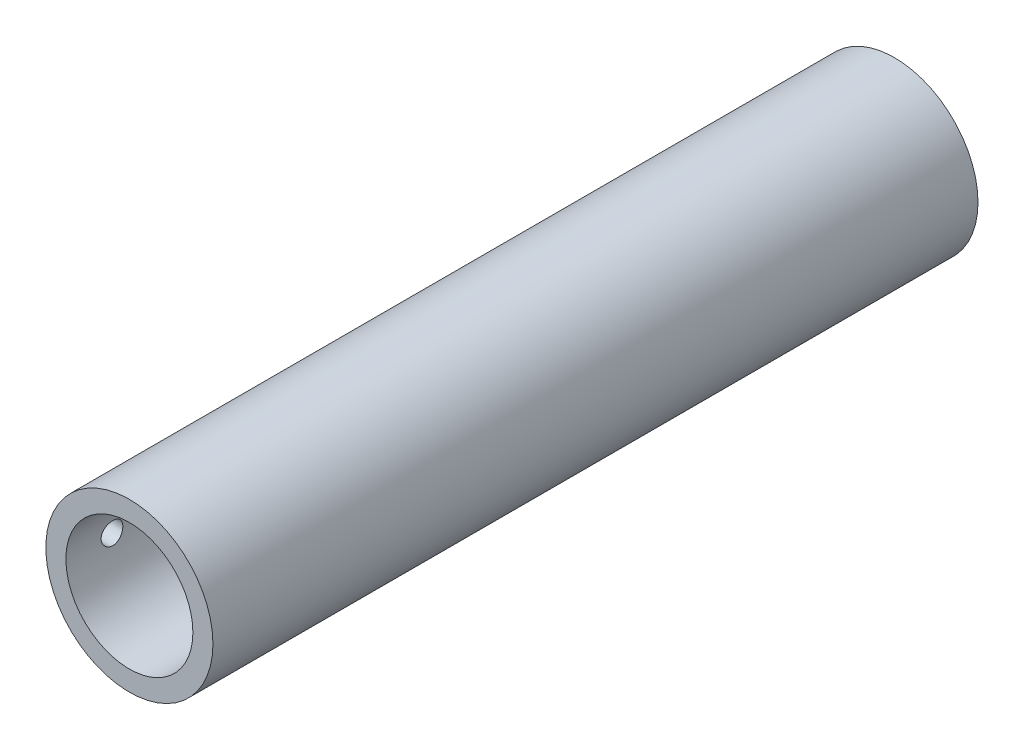
ISO-10303-21;
HEADER;
FILE_DESCRIPTION(('STEP AP214'),'2;1');
FILE_NAME('part.step','',(''),(''),'','','');
FILE_SCHEMA(('AUTOMOTIVE_DESIGN { 1 0 10303 214 1 1 1 1 }'));
ENDSEC;
DATA;
#1=APPLICATION_CONTEXT('core data for automotive mechanical design processes');
#2=APPLICATION_PROTOCOL_DEFINITION('international standard','automotive_design',2000,#1);
#3=PRODUCT_CONTEXT('',#1,'mechanical');
#4=PRODUCT('Part','Part','',(#3));
#5=PRODUCT_RELATED_PRODUCT_CATEGORY('part','',(#4));
#6=PRODUCT_DEFINITION_FORMATION('','',#4);
#7=PRODUCT_DEFINITION_CONTEXT('part definition',#1,'design');
#8=PRODUCT_DEFINITION('design','',#6,#7);
#9=PRODUCT_DEFINITION_SHAPE('','',#8);
#10=(LENGTH_UNIT() NAMED_UNIT(*) SI_UNIT(.MILLI.,.METRE.));
#11=(NAMED_UNIT(*) PLANE_ANGLE_UNIT() SI_UNIT($,.RADIAN.));
#12=(NAMED_UNIT(*) SI_UNIT($,.STERADIAN.) SOLID_ANGLE_UNIT());
#13=UNCERTAINTY_MEASURE_WITH_UNIT(LENGTH_MEASURE(1.E-05),#10,'distance_accuracy_value','');
#14=(GEOMETRIC_REPRESENTATION_CONTEXT(3) GLOBAL_UNCERTAINTY_ASSIGNED_CONTEXT((#13)) GLOBAL_UNIT_ASSIGNED_CONTEXT((#10,
#11,#12)) REPRESENTATION_CONTEXT('',''));
#15=CARTESIAN_POINT('',(0.,0.,0.));
#16=DIRECTION('',(0.,0.,1.));
#17=DIRECTION('',(1.,0.,0.));
#18=AXIS2_PLACEMENT_3D('',#15,#16,#17);
#19=CARTESIAN_POINT('',(0.,0.,116.3));
#20=DIRECTION('',(0.,0.,1.));
#21=DIRECTION('',(1.,0.,0.));
#22=AXIS2_PLACEMENT_3D('',#19,#20,#21);
#23=PLANE('',#22);
#24=CARTESIAN_POINT('',(0.,0.,116.3));
#25=DIRECTION('',(0.,0.,1.));
#26=DIRECTION('',(1.,0.,0.));
#27=AXIS2_PLACEMENT_3D('',#24,#25,#26);
#28=CIRCLE('',#27,12.7);
#29=CARTESIAN_POINT('',(12.7,0.,116.3));
#30=VERTEX_POINT('',#29);
#31=EDGE_CURVE('E10',#30,#30,#28,.T.);
#32=ORIENTED_EDGE('',*,*,#31,.T.);
#33=EDGE_LOOP('',(#32));
#34=FACE_BOUND('',#33,.T.);
#35=CARTESIAN_POINT('',(0.,0.,116.3));
#36=DIRECTION('',(0.,0.,1.));
#37=DIRECTION('',(1.,0.,0.));
#38=AXIS2_PLACEMENT_3D('',#35,#36,#37);
#39=CIRCLE('',#38,9.652);
#40=CARTESIAN_POINT('',(9.652,0.,116.3));
#41=VERTEX_POINT('',#40);
#42=EDGE_CURVE('E48',#41,#41,#39,.T.);
#43=ORIENTED_EDGE('',*,*,#42,.F.);
#44=EDGE_LOOP('',(#43));
#45=FACE_BOUND('',#44,.T.);
#46=ADVANCED_FACE('F30',(#34,#45),#23,.T.);
#47=CARTESIAN_POINT('',(0.,0.,0.));
#48=DIRECTION('',(0.,0.,1.));
#49=DIRECTION('',(1.,0.,0.));
#50=AXIS2_PLACEMENT_3D('',#47,#48,#49);
#51=PLANE('',#50);
#52=CARTESIAN_POINT('',(0.,0.,0.));
#53=DIRECTION('',(0.,0.,1.));
#54=DIRECTION('',(1.,0.,0.));
#55=AXIS2_PLACEMENT_3D('',#52,#53,#54);
#56=CIRCLE('',#55,12.7);
#57=CARTESIAN_POINT('',(12.7,0.,0.));
#58=VERTEX_POINT('',#57);
#59=EDGE_CURVE('E43',#58,#58,#56,.T.);
#60=ORIENTED_EDGE('',*,*,#59,.F.);
#61=EDGE_LOOP('',(#60));
#62=FACE_BOUND('',#61,.T.);
#63=CARTESIAN_POINT('',(0.,0.,0.));
#64=DIRECTION('',(0.,0.,1.));
#65=DIRECTION('',(1.,0.,0.));
#66=AXIS2_PLACEMENT_3D('',#63,#64,#65);
#67=CIRCLE('',#66,9.652);
#68=CARTESIAN_POINT('',(9.652,0.,0.));
#69=VERTEX_POINT('',#68);
#70=EDGE_CURVE('E51',#69,#69,#67,.T.);
#71=ORIENTED_EDGE('',*,*,#70,.T.);
#72=EDGE_LOOP('',(#71));
#73=FACE_BOUND('',#72,.T.);
#74=ADVANCED_FACE('F89',(#62,#73),#51,.F.);
#75=CARTESIAN_POINT('',(0.,0.,116.3));
#76=DIRECTION('',(0.,0.,-1.));
#77=DIRECTION('',(-1.,0.,0.));
#78=AXIS2_PLACEMENT_3D('',#75,#76,#77);
#79=CYLINDRICAL_SURFACE('',#78,12.7);
#80=CARTESIAN_POINT('',(-12.7,0.,19.65));
#81=CARTESIAN_POINT('',(-12.699998671994,-0.0922643236544295,19.6499960993866));
#82=CARTESIAN_POINT('',(-12.698983958577,-0.184585551831701,19.6422350776441));
#83=CARTESIAN_POINT('',(-12.6950336792189,-0.366656916033324,19.6113985477574));
#84=CARTESIAN_POINT('',(-12.6920961323539,-0.456404300819859,19.5883072458417));
#85=CARTESIAN_POINT('',(-12.6846309677445,-0.630665930682718,19.5275037753508));
#86=CARTESIAN_POINT('',(-12.6801044447016,-0.71518373156913,19.4898016708151));
#87=CARTESIAN_POINT('',(-12.6699641706627,-0.876677189933744,19.4008693250264));
#88=CARTESIAN_POINT('',(-12.6643505996702,-0.95365409292974,19.3496413230063));
#89=CARTESIAN_POINT('',(-12.6526253110227,-1.09835248039503,19.2347869029813));
#90=CARTESIAN_POINT('',(-12.6465111134287,-1.16602280747751,19.1710962813662));
#91=CARTESIAN_POINT('',(-12.6344935666052,-1.28974639524778,19.0332624968274));
#92=CARTESIAN_POINT('',(-12.628590228375,-1.34579905063923,18.9591187896218));
#93=CARTESIAN_POINT('',(-12.6176384748391,-1.44488838552917,18.8021488625616));
#94=CARTESIAN_POINT('',(-12.6125932570568,-1.48787683376439,18.7192919537546));
#95=CARTESIAN_POINT('',(-12.6039619389787,-1.5593094185057,18.5474581968473));
#96=CARTESIAN_POINT('',(-12.6003757789891,-1.58775415004512,18.4584815992935));
#97=CARTESIAN_POINT('',(-12.5950924525977,-1.62913573830676,18.2774665801611));
#98=CARTESIAN_POINT('',(-12.5933847384283,-1.64215921967967,18.1854482749958));
#99=CARTESIAN_POINT('',(-12.5920194334868,-1.65259672218689,18.0005175379805));
#100=CARTESIAN_POINT('',(-12.5923617538666,-1.65001141980308,17.9076051450544));
#101=CARTESIAN_POINT('',(-12.595048187675,-1.62937579148491,17.7241288688152));
#102=CARTESIAN_POINT('',(-12.5973799247535,-1.61142107783956,17.6335540249308));
#103=CARTESIAN_POINT('',(-12.6037631561011,-1.5607055639362,17.4567138339631));
#104=CARTESIAN_POINT('',(-12.6078146877641,-1.52794444173763,17.3704485806299));
#105=CARTESIAN_POINT('',(-12.6171949708476,-1.44844392150681,17.2043804162318));
#106=CARTESIAN_POINT('',(-12.6225274916691,-1.40166316722615,17.1245975249262));
#107=CARTESIAN_POINT('',(-12.6338660357438,-1.29548087678776,16.9739782704504));
#108=CARTESIAN_POINT('',(-12.6398720922543,-1.23607871729085,16.9031423494239));
#109=CARTESIAN_POINT('',(-12.6519359349322,-1.10581086214983,16.7718729916681));
#110=CARTESIAN_POINT('',(-12.6579937721697,-1.03486279102087,16.7115212765879));
#111=CARTESIAN_POINT('',(-12.6694366630254,-0.88380016891583,16.6035704482251));
#112=CARTESIAN_POINT('',(-12.6748217148723,-0.803685593808555,16.5559713685154));
#113=CARTESIAN_POINT('',(-12.6843160147836,-0.63649967309915,16.4748761601947));
#114=CARTESIAN_POINT('',(-12.6884247801714,-0.549425711153014,16.4413853654701));
#115=CARTESIAN_POINT('',(-12.6948992577755,-0.370824682195501,16.3895234061737));
#116=CARTESIAN_POINT('',(-12.697265058189,-0.279297840757889,16.371151476554));
#117=CARTESIAN_POINT('',(-12.6999755412598,-0.0950955304063152,16.3501551787095));
#118=CARTESIAN_POINT('',(-12.7003346666506,-0.00243309291156879,16.3474182765857));
#119=CARTESIAN_POINT('',(-12.6990303893535,0.182029172649091,16.357472431121));
#120=CARTESIAN_POINT('',(-12.6973670332797,0.273829020546804,16.3702631299003));
#121=CARTESIAN_POINT('',(-12.6922136724169,0.453626581786285,16.4109158980895));
#122=CARTESIAN_POINT('',(-12.6887301983133,0.541636678825491,16.4387240957699));
#123=CARTESIAN_POINT('',(-12.6803264597727,0.711744460747919,16.508566334189));
#124=CARTESIAN_POINT('',(-12.6754061430132,0.793841930187297,16.5506008929889));
#125=CARTESIAN_POINT('',(-12.6646409367626,0.950295185231418,16.6479734015425));
#126=CARTESIAN_POINT('',(-12.6587910675818,1.02460547698563,16.7033838884147));
#127=CARTESIAN_POINT('',(-12.6468361529216,1.1629116045171,16.8258330336537));
#128=CARTESIAN_POINT('',(-12.6407310964754,1.22690699643533,16.8928721921545));
#129=CARTESIAN_POINT('',(-12.6289090948121,1.34316787630945,17.0371723820807));
#130=CARTESIAN_POINT('',(-12.6231947745924,1.39535861022104,17.114493888558));
#131=CARTESIAN_POINT('',(-12.6128450368234,1.48601166201335,17.2768714872004));
#132=CARTESIAN_POINT('',(-12.608209596199,1.52447427352192,17.3619274138868));
#133=CARTESIAN_POINT('',(-12.6005605644568,1.58645918066333,17.537121581791));
#134=CARTESIAN_POINT('',(-12.5975424576628,1.61002310764714,17.6272448879302));
#135=CARTESIAN_POINT('',(-12.5934570424689,1.64167555648318,17.810211071314));
#136=CARTESIAN_POINT('',(-12.5923896354139,1.6497648609532,17.9030538107841));
#137=CARTESIAN_POINT('',(-12.5923295044501,1.65022329929213,18.0880794669048));
#138=CARTESIAN_POINT('',(-12.5933212793996,1.64270988744748,18.180262109445));
#139=CARTESIAN_POINT('',(-12.5972343720598,1.61242543776057,18.3620422465991));
#140=CARTESIAN_POINT('',(-12.6001556894471,1.58965440247592,18.4516397416462));
#141=CARTESIAN_POINT('',(-12.6075937988727,1.52953872075528,18.6256876277994));
#142=CARTESIAN_POINT('',(-12.6121099196059,1.49220020555893,18.7101401670758));
#143=CARTESIAN_POINT('',(-12.6222298315788,1.40402101075824,18.8716002244482));
#144=CARTESIAN_POINT('',(-12.6278336407552,1.35318010848692,18.9486076197382));
#145=CARTESIAN_POINT('',(-12.6395480159047,1.23900511908698,19.0935912412377));
#146=CARTESIAN_POINT('',(-12.6456619453046,1.17558357087424,19.1614983252901));
#147=CARTESIAN_POINT('',(-12.6576782655565,1.03823082260806,19.2857502994317));
#148=CARTESIAN_POINT('',(-12.6635806063442,0.964297155552046,19.3420924678398));
#149=CARTESIAN_POINT('',(-12.6745356710738,0.807668864253324,19.4418142460819));
#150=CARTESIAN_POINT('',(-12.6795848100563,0.724939541916109,19.4851397277499));
#151=CARTESIAN_POINT('',(-12.6882285390702,0.553358526270597,19.5572202244295));
#152=CARTESIAN_POINT('',(-12.6918246953228,0.464513546845602,19.5859909370196));
#153=CARTESIAN_POINT('',(-12.6962987165773,0.312682965856719,19.6213236033954));
#154=CARTESIAN_POINT('',(-12.6976798697008,0.250651402771433,19.6320616211651));
#155=CARTESIAN_POINT('',(-12.6995309602848,0.125755368432594,19.6464011196012));
#156=CARTESIAN_POINT('',(-12.7000009052199,0.0628909040155512,19.6500026588078));
#157=CARTESIAN_POINT('',(-12.7,0.,19.65));
#158=B_SPLINE_CURVE_WITH_KNOTS('',3,(#80,#81,#82,#83,#84,#85,#86,#87,#88,#89,#90,#91,#92,#93,
#94,#95,#96,#97,#98,#99,#100,#101,#102,#103,#104,#105,#106,#107,#108,#109,#110,#111,#112,#113,
#114,#115,#116,#117,#118,#119,#120,#121,#122,#123,#124,#125,#126,#127,#128,#129,#130,#131,#132,
#133,#134,#135,#136,#137,#138,#139,#140,#141,#142,#143,#144,#145,#146,#147,#148,#149,#150,#151,
#152,#153,#154,#155,#156,#157),.UNSPECIFIED.,.T.,.F.,(4,2,2,2,2,2,2,2,2,2,2,2,2,2,2,2,2,2,2,2,2,
2,2,2,2,2,2,2,2,2,2,2,2,2,2,2,2,2,4),(0.,0.276563234458575,0.553411836748439,0.830070081448885,
1.10668255364166,1.38475946205799,1.66285085501547,1.94195678834349,2.22105130157668,
2.49857052626908,2.77607772341464,3.05187100580365,3.327670285144,3.60429128462151,
3.88092594888515,4.15962857981392,4.43833194445556,4.71714058346983,4.99593511328558,
5.27272045235994,5.54949941221465,5.82529202502768,6.10109468207042,6.37842800235833,
6.65577325335371,6.93482849066395,7.21387775896393,7.49214379394402,7.77039575544941,
8.04656068399889,8.32272556625544,8.59877433991895,8.8748276661675,9.1528719974547,
9.43098168870937,9.71023234573239,9.98918118039051,10.1776988416266,10.3662149564546),.UNSPECIFIED.);
#159=CARTESIAN_POINT('',(-12.7,0.,19.65));
#160=VERTEX_POINT('',#159);
#161=EDGE_CURVE('E148',#160,#160,#158,.T.);
#162=ORIENTED_EDGE('',*,*,#161,.T.);
#163=EDGE_LOOP('',(#162));
#164=FACE_BOUND('',#163,.T.);
#165=CARTESIAN_POINT('',(-12.7,0.,31.45));
#166=CARTESIAN_POINT('',(-12.699998671994,-0.0922643236544294,31.4499960993866));
#167=CARTESIAN_POINT('',(-12.698983958577,-0.184585551831701,31.4422350776441));
#168=CARTESIAN_POINT('',(-12.6950336792189,-0.366656916033324,31.4113985477574));
#169=CARTESIAN_POINT('',(-12.6920961323539,-0.456404300819858,31.3883072458417));
#170=CARTESIAN_POINT('',(-12.6846309677445,-0.630665930682718,31.3275037753508));
#171=CARTESIAN_POINT('',(-12.6801044447016,-0.71518373156913,31.2898016708151));
#172=CARTESIAN_POINT('',(-12.6699641706627,-0.876677189933744,31.2008693250264));
#173=CARTESIAN_POINT('',(-12.6643505996702,-0.95365409292974,31.1496413230063));
#174=CARTESIAN_POINT('',(-12.6526253110227,-1.09835248039503,31.0347869029813));
#175=CARTESIAN_POINT('',(-12.6465111134287,-1.16602280747751,30.9710962813662));
#176=CARTESIAN_POINT('',(-12.6344935666052,-1.28974639524778,30.8332624968274));
#177=CARTESIAN_POINT('',(-12.628590228375,-1.34579905063923,30.7591187896218));
#178=CARTESIAN_POINT('',(-12.6176384748391,-1.44488838552917,30.6021488625616));
#179=CARTESIAN_POINT('',(-12.6125932570568,-1.48787683376439,30.5192919537546));
#180=CARTESIAN_POINT('',(-12.6039619389787,-1.5593094185057,30.3474581968473));
#181=CARTESIAN_POINT('',(-12.6003757789891,-1.58775415004512,30.2584815992935));
#182=CARTESIAN_POINT('',(-12.5950924525977,-1.62913573830676,30.0774665801611));
#183=CARTESIAN_POINT('',(-12.5933847384283,-1.64215921967967,29.9854482749958));
#184=CARTESIAN_POINT('',(-12.5920194334868,-1.65259672218689,29.8005175379805));
#185=CARTESIAN_POINT('',(-12.5923617538666,-1.65001141980308,29.7076051450544));
#186=CARTESIAN_POINT('',(-12.595048187675,-1.62937579148491,29.5241288688152));
#187=CARTESIAN_POINT('',(-12.5973799247535,-1.61142107783956,29.4335540249308));
#188=CARTESIAN_POINT('',(-12.6037631561011,-1.5607055639362,29.2567138339631));
#189=CARTESIAN_POINT('',(-12.6078146877641,-1.52794444173763,29.1704485806299));
#190=CARTESIAN_POINT('',(-12.6171949708476,-1.44844392150681,29.0043804162318));
#191=CARTESIAN_POINT('',(-12.6225274916691,-1.40166316722616,28.9245975249262));
#192=CARTESIAN_POINT('',(-12.6338660357438,-1.29548087678777,28.7739782704504));
#193=CARTESIAN_POINT('',(-12.6398720922543,-1.23607871729085,28.7031423494239));
#194=CARTESIAN_POINT('',(-12.6519359349322,-1.10581086214984,28.5718729916681));
#195=CARTESIAN_POINT('',(-12.6579937721697,-1.03486279102088,28.5115212765879));
#196=CARTESIAN_POINT('',(-12.6694366630254,-0.883800168915834,28.403570448225));
#197=CARTESIAN_POINT('',(-12.6748217148723,-0.803685593808557,28.3559713685154));
#198=CARTESIAN_POINT('',(-12.6843160147836,-0.63649967309915,28.2748761601947));
#199=CARTESIAN_POINT('',(-12.6884247801714,-0.549425711153014,28.2413853654701));
#200=CARTESIAN_POINT('',(-12.6948992577755,-0.370824682195502,28.1895234061737));
#201=CARTESIAN_POINT('',(-12.697265058189,-0.27929784075789,28.171151476554));
#202=CARTESIAN_POINT('',(-12.6999755412598,-0.0950955304063156,28.1501551787095));
#203=CARTESIAN_POINT('',(-12.7003346666506,-0.00243309291156915,28.1474182765857));
#204=CARTESIAN_POINT('',(-12.6990303893535,0.182029172649091,28.157472431121));
#205=CARTESIAN_POINT('',(-12.6973670332797,0.273829020546803,28.1702631299003));
#206=CARTESIAN_POINT('',(-12.6922136724169,0.453626581786285,28.2109158980895));
#207=CARTESIAN_POINT('',(-12.6887301983133,0.541636678825491,28.2387240957699));
#208=CARTESIAN_POINT('',(-12.6803264597727,0.711744460747919,28.308566334189));
#209=CARTESIAN_POINT('',(-12.6754061430132,0.793841930187297,28.3506008929889));
#210=CARTESIAN_POINT('',(-12.6646409367626,0.950295185231418,28.4479734015425));
#211=CARTESIAN_POINT('',(-12.6587910675818,1.02460547698563,28.5033838884147));
#212=CARTESIAN_POINT('',(-12.6468361529216,1.1629116045171,28.6258330336536));
#213=CARTESIAN_POINT('',(-12.6407310964754,1.22690699643533,28.6928721921545));
#214=CARTESIAN_POINT('',(-12.6289090948121,1.34316787630945,28.8371723820807));
#215=CARTESIAN_POINT('',(-12.6231947745924,1.39535861022104,28.9144938885579));
#216=CARTESIAN_POINT('',(-12.6128450368234,1.48601166201335,29.0768714872003));
#217=CARTESIAN_POINT('',(-12.608209596199,1.52447427352192,29.1619274138868));
#218=CARTESIAN_POINT('',(-12.6005605644568,1.58645918066333,29.337121581791));
#219=CARTESIAN_POINT('',(-12.5975424576628,1.61002310764714,29.4272448879302));
#220=CARTESIAN_POINT('',(-12.5934570424689,1.64167555648318,29.6102110713139));
#221=CARTESIAN_POINT('',(-12.5923896354139,1.6497648609532,29.7030538107841));
#222=CARTESIAN_POINT('',(-12.5923295044501,1.65022329929213,29.8880794669048));
#223=CARTESIAN_POINT('',(-12.5933212793996,1.64270988744748,29.980262109445));
#224=CARTESIAN_POINT('',(-12.5972343720598,1.61242543776057,30.1620422465991));
#225=CARTESIAN_POINT('',(-12.6001556894471,1.58965440247592,30.2516397416462));
#226=CARTESIAN_POINT('',(-12.6075937988727,1.52953872075528,30.4256876277994));
#227=CARTESIAN_POINT('',(-12.6121099196059,1.49220020555893,30.5101401670758));
#228=CARTESIAN_POINT('',(-12.6222298315788,1.40402101075824,30.6716002244481));
#229=CARTESIAN_POINT('',(-12.6278336407552,1.35318010848692,30.7486076197381));
#230=CARTESIAN_POINT('',(-12.6395480159047,1.23900511908698,30.8935912412377));
#231=CARTESIAN_POINT('',(-12.6456619453046,1.17558357087424,30.9614983252901));
#232=CARTESIAN_POINT('',(-12.6576782655565,1.03823082260806,31.0857502994317));
#233=CARTESIAN_POINT('',(-12.6635806063442,0.964297155552046,31.1420924678398));
#234=CARTESIAN_POINT('',(-12.6745356710738,0.807668864253324,31.2418142460819));
#235=CARTESIAN_POINT('',(-12.6795848100563,0.72493954191611,31.2851397277499));
#236=CARTESIAN_POINT('',(-12.6882285390702,0.553358526270598,31.3572202244294));
#237=CARTESIAN_POINT('',(-12.6918246953228,0.464513546845604,31.3859909370196));
#238=CARTESIAN_POINT('',(-12.6962987165773,0.312682965856723,31.4213236033954));
#239=CARTESIAN_POINT('',(-12.6976798697008,0.250651402771435,31.4320616211651));
#240=CARTESIAN_POINT('',(-12.6995309602848,0.125755368432595,31.4464011196012));
#241=CARTESIAN_POINT('',(-12.7000009052199,0.062890904015552,31.4500026588078));
#242=CARTESIAN_POINT('',(-12.7,0.,31.45));
#243=B_SPLINE_CURVE_WITH_KNOTS('',3,(#165,#166,#167,#168,#169,#170,#171,#172,#173,#174,#175,
#176,#177,#178,#179,#180,#181,#182,#183,#184,#185,#186,#187,#188,#189,#190,#191,#192,#193,#194,
#195,#196,#197,#198,#199,#200,#201,#202,#203,#204,#205,#206,#207,#208,#209,#210,#211,#212,#213,
#214,#215,#216,#217,#218,#219,#220,#221,#222,#223,#224,#225,#226,#227,#228,#229,#230,#231,#232,
#233,#234,#235,#236,#237,#238,#239,#240,#241,#242),.UNSPECIFIED.,.T.,.F.,(4,2,2,2,2,2,2,2,2,2,2,
2,2,2,2,2,2,2,2,2,2,2,2,2,2,2,2,2,2,2,2,2,2,2,2,2,2,2,4),(0.,0.276563234458575,
0.553411836748439,0.830070081448886,1.10668255364166,1.38475946205799,1.66285085501547,
1.94195678834349,2.22105130157668,2.49857052626908,2.77607772341464,3.05187100580364,
3.327670285144,3.6042912846215,3.88092594888515,4.15962857981391,4.43833194445556,
4.71714058346983,4.99593511328558,5.27272045235994,5.54949941221465,5.82529202502767,
6.10109468207042,6.37842800235833,6.65577325335371,6.93482849066395,7.21387775896393,
7.49214379394402,7.7703957554494,8.04656068399889,8.32272556625544,8.59877433991895,
8.8748276661675,9.1528719974547,9.43098168870937,9.71023234573239,9.9891811803905,
10.1776988416266,10.3662149564546),.UNSPECIFIED.);
#244=CARTESIAN_POINT('',(-12.7,0.,31.45));
#245=VERTEX_POINT('',#244);
#246=EDGE_CURVE('E60',#245,#245,#243,.T.);
#247=ORIENTED_EDGE('',*,*,#246,.T.);
#248=EDGE_LOOP('',(#247));
#249=FACE_BOUND('',#248,.T.);
#250=CARTESIAN_POINT('',(-12.7,0.,110.95));
#251=CARTESIAN_POINT('',(-12.699998671994,-0.0922643236544302,110.949996099387));
#252=CARTESIAN_POINT('',(-12.698983958577,-0.184585551831703,110.942235077644));
#253=CARTESIAN_POINT('',(-12.6950336792189,-0.366656916033327,110.911398547757));
#254=CARTESIAN_POINT('',(-12.6920961323539,-0.456404300819861,110.888307245842));
#255=CARTESIAN_POINT('',(-12.6846309677445,-0.630665930682723,110.827503775351));
#256=CARTESIAN_POINT('',(-12.6801044447016,-0.715183731569136,110.789801670815));
#257=CARTESIAN_POINT('',(-12.6699641706627,-0.876677189933752,110.700869325026));
#258=CARTESIAN_POINT('',(-12.6643505996702,-0.953654092929749,110.649641323006));
#259=CARTESIAN_POINT('',(-12.6526253110227,-1.09835248039504,110.534786902981));
#260=CARTESIAN_POINT('',(-12.6465111134287,-1.16602280747752,110.471096281366));
#261=CARTESIAN_POINT('',(-12.6344935666052,-1.28974639524779,110.333262496827));
#262=CARTESIAN_POINT('',(-12.628590228375,-1.34579905063924,110.259118789622));
#263=CARTESIAN_POINT('',(-12.6176384748391,-1.44488838552918,110.102148862562));
#264=CARTESIAN_POINT('',(-12.6125932570568,-1.4878768337644,110.019291953755));
#265=CARTESIAN_POINT('',(-12.6039619389787,-1.55930941850571,109.847458196847));
#266=CARTESIAN_POINT('',(-12.6003757789891,-1.58775415004513,109.758481599294));
#267=CARTESIAN_POINT('',(-12.5950924525977,-1.62913573830677,109.577466580161));
#268=CARTESIAN_POINT('',(-12.5933847384283,-1.64215921967968,109.485448274996));
#269=CARTESIAN_POINT('',(-12.5920194334868,-1.65259672218691,109.300517537981));
#270=CARTESIAN_POINT('',(-12.5923617538666,-1.6500114198031,109.207605145054));
#271=CARTESIAN_POINT('',(-12.5950481876749,-1.62937579148492,109.024128868815));
#272=CARTESIAN_POINT('',(-12.5973799247535,-1.61142107783958,108.933554024931));
#273=CARTESIAN_POINT('',(-12.6037631561011,-1.56070556393621,108.756713833963));
#274=CARTESIAN_POINT('',(-12.6078146877641,-1.52794444173765,108.67044858063));
#275=CARTESIAN_POINT('',(-12.6171949708476,-1.44844392150683,108.504380416232));
#276=CARTESIAN_POINT('',(-12.6225274916691,-1.40166316722617,108.424597524926));
#277=CARTESIAN_POINT('',(-12.6338660357438,-1.29548087678777,108.27397827045));
#278=CARTESIAN_POINT('',(-12.6398720922543,-1.23607871729086,108.203142349424));
#279=CARTESIAN_POINT('',(-12.6519359349322,-1.10581086214985,108.071872991668));
#280=CARTESIAN_POINT('',(-12.6579937721697,-1.03486279102089,108.011521276588));
#281=CARTESIAN_POINT('',(-12.6694366630254,-0.883800168915846,107.903570448225));
#282=CARTESIAN_POINT('',(-12.6748217148723,-0.803685593808568,107.855971368515));
#283=CARTESIAN_POINT('',(-12.6843160147836,-0.636499673099159,107.774876160195));
#284=CARTESIAN_POINT('',(-12.6884247801714,-0.549425711153022,107.74138536547));
#285=CARTESIAN_POINT('',(-12.6948992577755,-0.370824682195508,107.689523406174));
#286=CARTESIAN_POINT('',(-12.697265058189,-0.279297840757896,107.671151476554));
#287=CARTESIAN_POINT('',(-12.6999755412598,-0.0950955304063196,107.650155178709));
#288=CARTESIAN_POINT('',(-12.7003346666506,-0.00243309291157178,107.647418276586));
#289=CARTESIAN_POINT('',(-12.6990303893535,0.18202917264909,107.657472431121));
#290=CARTESIAN_POINT('',(-12.6973670332797,0.273829020546804,107.6702631299));
#291=CARTESIAN_POINT('',(-12.6922136724169,0.453626581786287,107.71091589809));
#292=CARTESIAN_POINT('',(-12.6887301983133,0.541636678825494,107.73872409577));
#293=CARTESIAN_POINT('',(-12.6803264597727,0.711744460747923,107.808566334189));
#294=CARTESIAN_POINT('',(-12.6754061430132,0.793841930187301,107.850600892989));
#295=CARTESIAN_POINT('',(-12.6646409367626,0.950295185231423,107.947973401542));
#296=CARTESIAN_POINT('',(-12.6587910675818,1.02460547698563,108.003383888415));
#297=CARTESIAN_POINT('',(-12.6468361529216,1.1629116045171,108.125833033654));
#298=CARTESIAN_POINT('',(-12.6407310964754,1.22690699643533,108.192872192154));
#299=CARTESIAN_POINT('',(-12.6289090948121,1.34316787630946,108.337172382081));
#300=CARTESIAN_POINT('',(-12.6231947745924,1.39535861022105,108.414493888558));
#301=CARTESIAN_POINT('',(-12.6128450368234,1.48601166201336,108.5768714872));
#302=CARTESIAN_POINT('',(-12.608209596199,1.52447427352193,108.661927413887));
#303=CARTESIAN_POINT('',(-12.6005605644568,1.58645918066334,108.837121581791));
#304=CARTESIAN_POINT('',(-12.5975424576628,1.61002310764716,108.92724488793));
#305=CARTESIAN_POINT('',(-12.5934570424689,1.6416755564832,109.110211071314));
#306=CARTESIAN_POINT('',(-12.5923896354139,1.64976486095322,109.203053810784));
#307=CARTESIAN_POINT('',(-12.5923295044501,1.65022329929215,109.388079466905));
#308=CARTESIAN_POINT('',(-12.5933212793996,1.64270988744749,109.480262109445));
#309=CARTESIAN_POINT('',(-12.5972343720598,1.61242543776058,109.662042246599));
#310=CARTESIAN_POINT('',(-12.6001556894471,1.58965440247593,109.751639741646));
#311=CARTESIAN_POINT('',(-12.6075937988727,1.52953872075529,109.925687627799));
#312=CARTESIAN_POINT('',(-12.6121099196059,1.49220020555895,110.010140167076));
#313=CARTESIAN_POINT('',(-12.6222298315788,1.40402101075826,110.171600224448));
#314=CARTESIAN_POINT('',(-12.6278336407552,1.35318010848693,110.248607619738));
#315=CARTESIAN_POINT('',(-12.6395480159047,1.23900511908699,110.393591241238));
#316=CARTESIAN_POINT('',(-12.6456619453046,1.17558357087426,110.46149832529));
#317=CARTESIAN_POINT('',(-12.6576782655565,1.03823082260808,110.585750299432));
#318=CARTESIAN_POINT('',(-12.6635806063442,0.964297155552065,110.64209246784));
#319=CARTESIAN_POINT('',(-12.6745356710738,0.807668864253342,110.741814246082));
#320=CARTESIAN_POINT('',(-12.6795848100563,0.724939541916125,110.78513972775));
#321=CARTESIAN_POINT('',(-12.6882285390702,0.553358526270607,110.857220224429));
#322=CARTESIAN_POINT('',(-12.6918246953228,0.464513546845611,110.88599093702));
#323=CARTESIAN_POINT('',(-12.6962987165773,0.312682965856726,110.921323603395));
#324=CARTESIAN_POINT('',(-12.6976798697008,0.250651402771438,110.932061621165));
#325=CARTESIAN_POINT('',(-12.6995309602848,0.125755368432597,110.946401119601));
#326=CARTESIAN_POINT('',(-12.7000009052199,0.0628909040155527,110.950002658808));
#327=CARTESIAN_POINT('',(-12.7,0.,110.95));
#328=B_SPLINE_CURVE_WITH_KNOTS('',3,(#250,#251,#252,#253,#254,#255,#256,#257,#258,#259,#260,
#261,#262,#263,#264,#265,#266,#267,#268,#269,#270,#271,#272,#273,#274,#275,#276,#277,#278,#279,
#280,#281,#282,#283,#284,#285,#286,#287,#288,#289,#290,#291,#292,#293,#294,#295,#296,#297,#298,
#299,#300,#301,#302,#303,#304,#305,#306,#307,#308,#309,#310,#311,#312,#313,#314,#315,#316,#317,
#318,#319,#320,#321,#322,#323,#324,#325,#326,#327),.UNSPECIFIED.,.T.,.F.,(4,2,2,2,2,2,2,2,2,2,2,
2,2,2,2,2,2,2,2,2,2,2,2,2,2,2,2,2,2,2,2,2,2,2,2,2,2,2,4),(0.,0.276563234458577,
0.553411836748443,0.830070081448891,1.10668255364167,1.384759462058,1.66285085501548,
1.9419567883435,2.22105130157671,2.4985705262691,2.77607772341466,3.05187100580367,
3.32767028514404,3.60429128462154,3.88092594888518,4.15962857981395,4.4383319444556,
4.71714058346987,4.99593511328562,5.27272045235999,5.5494994122147,5.82529202502773,
6.10109468207047,6.37842800235838,6.65577325335377,6.934828490664,7.21387775896399,
7.4921437939441,7.77039575544948,8.04656068399896,8.32272556625552,8.59877433991903,
8.87482766616757,9.15287199745477,9.43098168870944,9.71023234573247,9.9891811803906,
10.1776988416267,10.3662149564547),.UNSPECIFIED.);
#329=CARTESIAN_POINT('',(-12.7,0.,110.95));
#330=VERTEX_POINT('',#329);
#331=EDGE_CURVE('E59',#330,#330,#328,.T.);
#332=ORIENTED_EDGE('',*,*,#331,.T.);
#333=EDGE_LOOP('',(#332));
#334=FACE_BOUND('',#333,.T.);
#335=ORIENTED_EDGE('',*,*,#31,.F.);
#336=EDGE_LOOP('',(#335));
#337=FACE_BOUND('',#336,.T.);
#338=ORIENTED_EDGE('',*,*,#59,.T.);
#339=EDGE_LOOP('',(#338));
#340=FACE_BOUND('',#339,.T.);
#341=ADVANCED_FACE('F32',(#164,#249,#334,#337,#340),#79,.T.);
#342=CARTESIAN_POINT('',(0.,0.,116.3));
#343=DIRECTION('',(0.,0.,-1.));
#344=DIRECTION('',(-1.,0.,0.));
#345=AXIS2_PLACEMENT_3D('',#342,#343,#344);
#346=CYLINDRICAL_SURFACE('',#345,9.652);
#347=CARTESIAN_POINT('',(-9.652,0.,19.65));
#348=CARTESIAN_POINT('',(-9.65199840216458,-0.0919628298950399,19.6499963442051));
#349=CARTESIAN_POINT('',(-9.65067202077969,-0.183974975733299,19.642285696692));
#350=CARTESIAN_POINT('',(-9.64550856906842,-0.365416216560566,19.6116610359921));
#351=CARTESIAN_POINT('',(-9.64166922727953,-0.454842898116841,19.5887332678014));
#352=CARTESIAN_POINT('',(-9.63191026175016,-0.628462082575436,19.5283888549681));
#353=CARTESIAN_POINT('',(-9.62599237510193,-0.712658887281701,19.4909843062826));
#354=CARTESIAN_POINT('',(-9.61272612998453,-0.873571323084405,19.4027803212136));
#355=CARTESIAN_POINT('',(-9.6053779256647,-0.950287759024988,19.35198232807));
#356=CARTESIAN_POINT('',(-9.58998249057883,-1.09484183582372,19.2378913384956));
#357=CARTESIAN_POINT('',(-9.58192957275087,-1.1625935158486,19.174490184964));
#358=CARTESIAN_POINT('',(-9.56607559102252,-1.28655210158152,19.0372253809964));
#359=CARTESIAN_POINT('',(-9.55827454345983,-1.34275825964655,18.9633610535288));
#360=CARTESIAN_POINT('',(-9.54375245958461,-1.44237739281358,18.8066727719618));
#361=CARTESIAN_POINT('',(-9.53703876906818,-1.48570488183152,18.7237937272709));
#362=CARTESIAN_POINT('',(-9.52553070601754,-1.55778998734419,18.5517998528044));
#363=CARTESIAN_POINT('',(-9.52073619689182,-1.5865486407674,18.4626854673396));
#364=CARTESIAN_POINT('',(-9.51366609249079,-1.62840788137453,18.2816634946021));
#365=CARTESIAN_POINT('',(-9.51136658980216,-1.64165717945919,18.1897912465686));
#366=CARTESIAN_POINT('',(-9.50947458614889,-1.65258279108199,18.0051010741469));
#367=CARTESIAN_POINT('',(-9.5098818836415,-1.65026026406594,17.9122832206805));
#368=CARTESIAN_POINT('',(-9.51333564476736,-1.63022917580694,17.7294012524156));
#369=CARTESIAN_POINT('',(-9.51635338401971,-1.61268806825615,17.6393181747397));
#370=CARTESIAN_POINT('',(-9.5246430122262,-1.5629807199128,17.4633927147069));
#371=CARTESIAN_POINT('',(-9.52991498215219,-1.53081395376466,17.3775504848045));
#372=CARTESIAN_POINT('',(-9.54214988630303,-1.45259979767748,17.2120443941199));
#373=CARTESIAN_POINT('',(-9.54912121098604,-1.40648325063483,17.132413861082));
#374=CARTESIAN_POINT('',(-9.56396356327337,-1.30172767465342,16.9819579718597));
#375=CARTESIAN_POINT('',(-9.57183466715562,-1.2430875836767,16.9111333632533));
#376=CARTESIAN_POINT('',(-9.58771571229775,-1.11403899573683,16.7793308184365));
#377=CARTESIAN_POINT('',(-9.59572612494008,-1.04348691121893,16.7184934388086));
#378=CARTESIAN_POINT('',(-9.61088837959566,-0.893101655559594,16.6094989408758));
#379=CARTESIAN_POINT('',(-9.61804021552919,-0.813268418704748,16.5613419123597));
#380=CARTESIAN_POINT('',(-9.63069044852088,-0.646452038458769,16.4790607852603));
#381=CARTESIAN_POINT('',(-9.63618733049777,-0.559462435724765,16.4449495349019));
#382=CARTESIAN_POINT('',(-9.64489624222869,-0.380873814913822,16.3918609772476));
#383=CARTESIAN_POINT('',(-9.64810847319769,-0.289275203524936,16.3728823371666));
#384=CARTESIAN_POINT('',(-9.65185898058014,-0.105279742819779,16.3507892749333));
#385=CARTESIAN_POINT('',(-9.65242976558138,-0.012906693328753,16.3474819715928));
#386=CARTESIAN_POINT('',(-9.65092225675758,0.171073382960651,16.3563106171026));
#387=CARTESIAN_POINT('',(-9.64884407035734,0.262680440670963,16.368445939702));
#388=CARTESIAN_POINT('',(-9.64229227443341,0.441929224742529,16.4076549382122));
#389=CARTESIAN_POINT('',(-9.63783404921964,0.529592540638017,16.4346327080306));
#390=CARTESIAN_POINT('',(-9.62702002815444,0.699152095093055,16.5026582590518));
#391=CARTESIAN_POINT('',(-9.62066412118924,0.781047995609692,16.5437068641561));
#392=CARTESIAN_POINT('',(-9.60667902250342,0.937582943180906,16.6391476990865));
#393=CARTESIAN_POINT('',(-9.59903859179688,1.01214781970716,16.6936598988938));
#394=CARTESIAN_POINT('',(-9.58336480300499,1.15114041897502,16.8143160248646));
#395=CARTESIAN_POINT('',(-9.57533141483094,1.21556736385866,16.8804608427459));
#396=CARTESIAN_POINT('',(-9.55967146555244,1.33317377360685,17.0233713200184));
#397=CARTESIAN_POINT('',(-9.5520503086572,1.38622265279268,17.1002451298476));
#398=CARTESIAN_POINT('',(-9.53818013887627,1.47865386602208,17.2619262673959));
#399=CARTESIAN_POINT('',(-9.53193108088812,1.51803664931043,17.3467333342091));
#400=CARTESIAN_POINT('',(-9.52155357076309,1.58182440984125,17.5215151107658));
#401=CARTESIAN_POINT('',(-9.51741607194088,1.60629337245159,17.6114659070489));
#402=CARTESIAN_POINT('',(-9.51170783169745,1.63975953560043,17.7942778195752));
#403=CARTESIAN_POINT('',(-9.51013685432296,1.64875815840924,17.8871386674828));
#404=CARTESIAN_POINT('',(-9.50975005747882,1.65098696703414,18.0718299667722));
#405=CARTESIAN_POINT('',(-9.51089830967865,1.64442277809946,18.1636579259101));
#406=CARTESIAN_POINT('',(-9.51574166961122,1.61615801622239,18.3448820269979));
#407=CARTESIAN_POINT('',(-9.5194367678263,1.59445749984509,18.4342781780342));
#408=CARTESIAN_POINT('',(-9.52894352803493,1.53661645706931,18.6080153926153));
#409=CARTESIAN_POINT('',(-9.53475246210317,1.50049453582126,18.6923628089629));
#410=CARTESIAN_POINT('',(-9.54783486255095,1.41485741668422,18.8538334894313));
#411=CARTESIAN_POINT('',(-9.55510840773296,1.36534149809062,18.930956364513));
#412=CARTESIAN_POINT('',(-9.57041392781059,1.2535918078549,19.0768259036186));
#413=CARTESIAN_POINT('',(-9.57845423313256,1.1912070677228,19.145456054873));
#414=CARTESIAN_POINT('',(-9.5943217177416,1.05580836016939,19.271343826572));
#415=CARTESIAN_POINT('',(-9.6021488474848,0.982791946458919,19.3285988224679));
#416=CARTESIAN_POINT('',(-9.61677451224209,0.827567447241628,19.4304951139892));
#417=CARTESIAN_POINT('',(-9.62356511637525,0.745296117803574,19.4750412192706));
#418=CARTESIAN_POINT('',(-9.63527544103631,0.574354004243485,19.5496114188607));
#419=CARTESIAN_POINT('',(-9.64019700320525,0.48568962251423,19.5796498161633));
#420=CARTESIAN_POINT('',(-9.64655446014133,0.330580321675195,19.6179139545702));
#421=CARTESIAN_POINT('',(-9.6485855028236,0.265067943735504,19.6299267021844));
#422=CARTESIAN_POINT('',(-9.65130883827116,0.133045636432329,19.6459709728497));
#423=CARTESIAN_POINT('',(-9.65200115604467,0.0665357257267747,19.6500026449922));
#424=CARTESIAN_POINT('',(-9.652,0.,19.65));
#425=B_SPLINE_CURVE_WITH_KNOTS('',3,(#347,#348,#349,#350,#351,#352,#353,#354,#355,#356,#357,
#358,#359,#360,#361,#362,#363,#364,#365,#366,#367,#368,#369,#370,#371,#372,#373,#374,#375,#376,
#377,#378,#379,#380,#381,#382,#383,#384,#385,#386,#387,#388,#389,#390,#391,#392,#393,#394,#395,
#396,#397,#398,#399,#400,#401,#402,#403,#404,#405,#406,#407,#408,#409,#410,#411,#412,#413,#414,
#415,#416,#417,#418,#419,#420,#421,#422,#423,#424),.UNSPECIFIED.,.T.,.F.,(4,2,2,2,2,2,2,2,2,2,2,
2,2,2,2,2,2,2,2,2,2,2,2,2,2,2,2,2,2,2,2,2,2,2,2,2,2,2,4),(0.,0.275645259643975,
0.551540019497062,0.827204753641873,1.1028397950613,1.38095118956939,1.65908058781413,
1.93901691575258,2.21893331658388,2.49614317437115,2.77333239191669,3.04750976437629,
3.32169698610149,3.59726643194244,3.87285925627045,4.15204847033646,4.43123966126798,
4.7106856750204,4.99010707420856,5.26608029131873,5.54204231713155,5.81624177742898,
6.09045729590248,6.36721047751499,6.64398488335865,6.9237834266561,7.20357277128059,
7.48215311584047,7.76070784766337,8.03560269876312,8.3104965225746,8.58503684413007,
8.85959194109895,9.1375725724483,9.41561726697254,9.69569291186285,9.975491866648,
10.1749267908637,10.3743579894739),.UNSPECIFIED.);
#426=CARTESIAN_POINT('',(-9.652,0.,19.65));
#427=VERTEX_POINT('',#426);
#428=EDGE_CURVE('E35',#427,#427,#425,.T.);
#429=ORIENTED_EDGE('',*,*,#428,.F.);
#430=EDGE_LOOP('',(#429));
#431=FACE_BOUND('',#430,.T.);
#432=CARTESIAN_POINT('',(-9.652,0.,31.45));
#433=CARTESIAN_POINT('',(-9.65199840216458,-0.0919628298950397,31.4499963442051));
#434=CARTESIAN_POINT('',(-9.65067202077969,-0.183974975733299,31.442285696692));
#435=CARTESIAN_POINT('',(-9.64550856906842,-0.365416216560566,31.4116610359921));
#436=CARTESIAN_POINT('',(-9.64166922727953,-0.454842898116841,31.3887332678014));
#437=CARTESIAN_POINT('',(-9.63191026175016,-0.628462082575436,31.3283888549681));
#438=CARTESIAN_POINT('',(-9.62599237510193,-0.712658887281703,31.2909843062826));
#439=CARTESIAN_POINT('',(-9.61272612998453,-0.873571323084408,31.2027803212136));
#440=CARTESIAN_POINT('',(-9.6053779256647,-0.95028775902499,31.15198232807));
#441=CARTESIAN_POINT('',(-9.58998249057883,-1.09484183582372,31.0378913384956));
#442=CARTESIAN_POINT('',(-9.58192957275087,-1.1625935158486,30.974490184964));
#443=CARTESIAN_POINT('',(-9.56607559102252,-1.28655210158152,30.8372253809964));
#444=CARTESIAN_POINT('',(-9.55827454345983,-1.34275825964655,30.7633610535288));
#445=CARTESIAN_POINT('',(-9.54375245958461,-1.44237739281358,30.6066727719618));
#446=CARTESIAN_POINT('',(-9.53703876906818,-1.48570488183152,30.5237937272709));
#447=CARTESIAN_POINT('',(-9.52553070601754,-1.55778998734419,30.3517998528044));
#448=CARTESIAN_POINT('',(-9.52073619689182,-1.5865486407674,30.2626854673396));
#449=CARTESIAN_POINT('',(-9.51366609249079,-1.62840788137453,30.0816634946021));
#450=CARTESIAN_POINT('',(-9.51136658980216,-1.64165717945919,29.9897912465686));
#451=CARTESIAN_POINT('',(-9.50947458614889,-1.65258279108199,29.8051010741469));
#452=CARTESIAN_POINT('',(-9.5098818836415,-1.65026026406594,29.7122832206805));
#453=CARTESIAN_POINT('',(-9.51333564476736,-1.63022917580694,29.5294012524156));
#454=CARTESIAN_POINT('',(-9.51635338401971,-1.61268806825615,29.4393181747397));
#455=CARTESIAN_POINT('',(-9.5246430122262,-1.5629807199128,29.2633927147069));
#456=CARTESIAN_POINT('',(-9.52991498215219,-1.53081395376466,29.1775504848045));
#457=CARTESIAN_POINT('',(-9.54214988630303,-1.45259979767748,29.0120443941199));
#458=CARTESIAN_POINT('',(-9.54912121098604,-1.40648325063483,28.932413861082));
#459=CARTESIAN_POINT('',(-9.56396356327337,-1.30172767465342,28.7819579718597));
#460=CARTESIAN_POINT('',(-9.57183466715562,-1.2430875836767,28.7111333632533));
#461=CARTESIAN_POINT('',(-9.58771571229775,-1.11403899573682,28.5793308184365));
#462=CARTESIAN_POINT('',(-9.59572612494008,-1.04348691121893,28.5184934388085));
#463=CARTESIAN_POINT('',(-9.61088837959566,-0.893101655559595,28.4094989408758));
#464=CARTESIAN_POINT('',(-9.61804021552919,-0.813268418704747,28.3613419123597));
#465=CARTESIAN_POINT('',(-9.63069044852088,-0.646452038458768,28.2790607852602));
#466=CARTESIAN_POINT('',(-9.63618733049777,-0.559462435724765,28.2449495349019));
#467=CARTESIAN_POINT('',(-9.64489624222869,-0.380873814913821,28.1918609772476));
#468=CARTESIAN_POINT('',(-9.64810847319769,-0.289275203524935,28.1728823371666));
#469=CARTESIAN_POINT('',(-9.65185898058014,-0.105279742819778,28.1507892749333));
#470=CARTESIAN_POINT('',(-9.65242976558138,-0.0129066933287522,28.1474819715928));
#471=CARTESIAN_POINT('',(-9.65092225675758,0.171073382960651,28.1563106171026));
#472=CARTESIAN_POINT('',(-9.64884407035734,0.262680440670963,28.168445939702));
#473=CARTESIAN_POINT('',(-9.64229227443341,0.44192922474253,28.2076549382122));
#474=CARTESIAN_POINT('',(-9.63783404921964,0.529592540638018,28.2346327080306));
#475=CARTESIAN_POINT('',(-9.62702002815444,0.699152095093056,28.3026582590518));
#476=CARTESIAN_POINT('',(-9.62066412118924,0.781047995609693,28.3437068641561));
#477=CARTESIAN_POINT('',(-9.60667902250342,0.937582943180907,28.4391476990865));
#478=CARTESIAN_POINT('',(-9.59903859179688,1.01214781970716,28.4936598988938));
#479=CARTESIAN_POINT('',(-9.58336480300499,1.15114041897502,28.6143160248646));
#480=CARTESIAN_POINT('',(-9.57533141483094,1.21556736385866,28.6804608427459));
#481=CARTESIAN_POINT('',(-9.55967146555244,1.33317377360685,28.8233713200184));
#482=CARTESIAN_POINT('',(-9.5520503086572,1.38622265279268,28.9002451298476));
#483=CARTESIAN_POINT('',(-9.53818013887627,1.47865386602208,29.0619262673959));
#484=CARTESIAN_POINT('',(-9.53193108088812,1.51803664931043,29.1467333342091));
#485=CARTESIAN_POINT('',(-9.52155357076309,1.58182440984125,29.3215151107658));
#486=CARTESIAN_POINT('',(-9.51741607194088,1.60629337245159,29.4114659070489));
#487=CARTESIAN_POINT('',(-9.51170783169745,1.63975953560043,29.5942778195752));
#488=CARTESIAN_POINT('',(-9.51013685432296,1.64875815840924,29.6871386674827));
#489=CARTESIAN_POINT('',(-9.50975005747882,1.65098696703414,29.8718299667722));
#490=CARTESIAN_POINT('',(-9.51089830967865,1.64442277809946,29.9636579259101));
#491=CARTESIAN_POINT('',(-9.51574166961122,1.61615801622239,30.1448820269979));
#492=CARTESIAN_POINT('',(-9.5194367678263,1.59445749984509,30.2342781780342));
#493=CARTESIAN_POINT('',(-9.52894352803494,1.53661645706931,30.4080153926153));
#494=CARTESIAN_POINT('',(-9.53475246210317,1.50049453582126,30.4923628089629));
#495=CARTESIAN_POINT('',(-9.54783486255095,1.41485741668422,30.6538334894313));
#496=CARTESIAN_POINT('',(-9.55510840773296,1.36534149809062,30.730956364513));
#497=CARTESIAN_POINT('',(-9.57041392781059,1.2535918078549,30.8768259036186));
#498=CARTESIAN_POINT('',(-9.57845423313256,1.1912070677228,30.945456054873));
#499=CARTESIAN_POINT('',(-9.5943217177416,1.05580836016939,31.071343826572));
#500=CARTESIAN_POINT('',(-9.6021488474848,0.982791946458918,31.1285988224679));
#501=CARTESIAN_POINT('',(-9.61677451224209,0.827567447241627,31.2304951139892));
#502=CARTESIAN_POINT('',(-9.62356511637525,0.745296117803571,31.2750412192706));
#503=CARTESIAN_POINT('',(-9.63527544103631,0.574354004243482,31.3496114188607));
#504=CARTESIAN_POINT('',(-9.64019700320525,0.485689622514229,31.3796498161633));
#505=CARTESIAN_POINT('',(-9.64655446014133,0.330580321675195,31.4179139545701));
#506=CARTESIAN_POINT('',(-9.6485855028236,0.265067943735503,31.4299267021844));
#507=CARTESIAN_POINT('',(-9.65130883827116,0.133045636432329,31.4459709728497));
#508=CARTESIAN_POINT('',(-9.65200115604467,0.0665357257267745,31.4500026449922));
#509=CARTESIAN_POINT('',(-9.652,0.,31.45));
#510=B_SPLINE_CURVE_WITH_KNOTS('',3,(#432,#433,#434,#435,#436,#437,#438,#439,#440,#441,#442,
#443,#444,#445,#446,#447,#448,#449,#450,#451,#452,#453,#454,#455,#456,#457,#458,#459,#460,#461,
#462,#463,#464,#465,#466,#467,#468,#469,#470,#471,#472,#473,#474,#475,#476,#477,#478,#479,#480,
#481,#482,#483,#484,#485,#486,#487,#488,#489,#490,#491,#492,#493,#494,#495,#496,#497,#498,#499,
#500,#501,#502,#503,#504,#505,#506,#507,#508,#509),.UNSPECIFIED.,.T.,.F.,(4,2,2,2,2,2,2,2,2,2,2,
2,2,2,2,2,2,2,2,2,2,2,2,2,2,2,2,2,2,2,2,2,2,2,2,2,2,2,4),(0.,0.275645259643975,
0.551540019497063,0.827204753641877,1.1028397950613,1.38095118956939,1.65908058781413,
1.93901691575258,2.21893331658388,2.49614317437114,2.77333239191668,3.04750976437628,
3.32169698610148,3.59726643194244,3.87285925627045,4.15204847033646,4.43123966126798,
4.7106856750204,4.99010707420856,5.26608029131873,5.54204231713155,5.81624177742898,
6.09045729590247,6.36721047751499,6.64398488335865,6.9237834266561,7.20357277128059,
7.48215311584047,7.76070784766337,8.03560269876312,8.3104965225746,8.58503684413007,
8.85959194109895,9.1375725724483,9.41561726697254,9.69569291186286,9.975491866648,
10.1749267908637,10.3743579894739),.UNSPECIFIED.);
#511=CARTESIAN_POINT('',(-9.652,0.,31.45));
#512=VERTEX_POINT('',#511);
#513=EDGE_CURVE('E61',#512,#512,#510,.T.);
#514=ORIENTED_EDGE('',*,*,#513,.F.);
#515=EDGE_LOOP('',(#514));
#516=FACE_BOUND('',#515,.T.);
#517=CARTESIAN_POINT('',(-9.652,0.,110.95));
#518=CARTESIAN_POINT('',(-9.65199840216458,-0.0919628298950416,110.949996344205));
#519=CARTESIAN_POINT('',(-9.65067202077969,-0.183974975733302,110.942285696692));
#520=CARTESIAN_POINT('',(-9.64550856906842,-0.365416216560571,110.911661035992));
#521=CARTESIAN_POINT('',(-9.64166922727953,-0.454842898116846,110.888733267801));
#522=CARTESIAN_POINT('',(-9.63191026175016,-0.628462082575441,110.828388854968));
#523=CARTESIAN_POINT('',(-9.62599237510193,-0.712658887281707,110.790984306283));
#524=CARTESIAN_POINT('',(-9.61272612998453,-0.873571323084414,110.702780321214));
#525=CARTESIAN_POINT('',(-9.6053779256647,-0.950287759025,110.65198232807));
#526=CARTESIAN_POINT('',(-9.58998249057883,-1.09484183582373,110.537891338496));
#527=CARTESIAN_POINT('',(-9.58192957275087,-1.16259351584861,110.474490184964));
#528=CARTESIAN_POINT('',(-9.56607559102252,-1.28655210158152,110.337225380996));
#529=CARTESIAN_POINT('',(-9.55827454345983,-1.34275825964656,110.263361053529));
#530=CARTESIAN_POINT('',(-9.54375245958461,-1.44237739281359,110.106672771962));
#531=CARTESIAN_POINT('',(-9.53703876906818,-1.48570488183153,110.023793727271));
#532=CARTESIAN_POINT('',(-9.52553070601754,-1.55778998734421,109.851799852804));
#533=CARTESIAN_POINT('',(-9.52073619689182,-1.58654864076742,109.76268546734));
#534=CARTESIAN_POINT('',(-9.51366609249078,-1.62840788137454,109.581663494602));
#535=CARTESIAN_POINT('',(-9.51136658980215,-1.6416571794592,109.489791246569));
#536=CARTESIAN_POINT('',(-9.50947458614888,-1.65258279108201,109.305101074147));
#537=CARTESIAN_POINT('',(-9.5098818836415,-1.65026026406595,109.21228322068));
#538=CARTESIAN_POINT('',(-9.51333564476736,-1.63022917580696,109.029401252416));
#539=CARTESIAN_POINT('',(-9.51635338401971,-1.61268806825616,108.93931817474));
#540=CARTESIAN_POINT('',(-9.52464301222619,-1.56298071991281,108.763392714707));
#541=CARTESIAN_POINT('',(-9.52991498215219,-1.53081395376467,108.677550484804));
#542=CARTESIAN_POINT('',(-9.54214988630303,-1.45259979767749,108.51204439412));
#543=CARTESIAN_POINT('',(-9.54912121098604,-1.40648325063484,108.432413861082));
#544=CARTESIAN_POINT('',(-9.56396356327337,-1.30172767465343,108.28195797186));
#545=CARTESIAN_POINT('',(-9.57183466715562,-1.24308758367671,108.211133363253));
#546=CARTESIAN_POINT('',(-9.58771571229775,-1.11403899573684,108.079330818436));
#547=CARTESIAN_POINT('',(-9.59572612494008,-1.04348691121895,108.018493438809));
#548=CARTESIAN_POINT('',(-9.61088837959566,-0.89310165555961,107.909498940876));
#549=CARTESIAN_POINT('',(-9.61804021552919,-0.813268418704758,107.86134191236));
#550=CARTESIAN_POINT('',(-9.63069044852088,-0.646452038458775,107.77906078526));
#551=CARTESIAN_POINT('',(-9.63618733049777,-0.559462435724772,107.744949534902));
#552=CARTESIAN_POINT('',(-9.64489624222869,-0.380873814913826,107.691860977248));
#553=CARTESIAN_POINT('',(-9.6481084731977,-0.289275203524937,107.672882337167));
#554=CARTESIAN_POINT('',(-9.65185898058014,-0.105279742819777,107.650789274933));
#555=CARTESIAN_POINT('',(-9.65242976558138,-0.0129066933287501,107.647481971593));
#556=CARTESIAN_POINT('',(-9.65092225675758,0.171073382960654,107.656310617103));
#557=CARTESIAN_POINT('',(-9.64884407035734,0.262680440670965,107.668445939702));
#558=CARTESIAN_POINT('',(-9.64229227443341,0.441929224742534,107.707654938212));
#559=CARTESIAN_POINT('',(-9.63783404921964,0.529592540638024,107.734632708031));
#560=CARTESIAN_POINT('',(-9.62702002815444,0.699152095093062,107.802658259052));
#561=CARTESIAN_POINT('',(-9.62066412118924,0.781047995609698,107.843706864156));
#562=CARTESIAN_POINT('',(-9.60667902250342,0.937582943180913,107.939147699086));
#563=CARTESIAN_POINT('',(-9.59903859179688,1.01214781970717,107.993659898894));
#564=CARTESIAN_POINT('',(-9.58336480300499,1.15114041897503,108.114316024865));
#565=CARTESIAN_POINT('',(-9.57533141483094,1.21556736385868,108.180460842746));
#566=CARTESIAN_POINT('',(-9.55967146555244,1.33317377360686,108.323371320018));
#567=CARTESIAN_POINT('',(-9.5520503086572,1.38622265279269,108.400245129848));
#568=CARTESIAN_POINT('',(-9.53818013887626,1.47865386602209,108.561926267396));
#569=CARTESIAN_POINT('',(-9.53193108088812,1.51803664931044,108.646733334209));
#570=CARTESIAN_POINT('',(-9.52155357076308,1.58182440984127,108.821515110766));
#571=CARTESIAN_POINT('',(-9.51741607194088,1.60629337245161,108.911465907049));
#572=CARTESIAN_POINT('',(-9.51170783169744,1.63975953560045,109.094277819575));
#573=CARTESIAN_POINT('',(-9.51013685432296,1.64875815840925,109.187138667483));
#574=CARTESIAN_POINT('',(-9.50975005747882,1.65098696703416,109.371829966772));
#575=CARTESIAN_POINT('',(-9.51089830967865,1.64442277809948,109.46365792591));
#576=CARTESIAN_POINT('',(-9.51574166961122,1.6161580162224,109.644882026998));
#577=CARTESIAN_POINT('',(-9.5194367678263,1.59445749984511,109.734278178034));
#578=CARTESIAN_POINT('',(-9.52894352803493,1.53661645706933,109.908015392615));
#579=CARTESIAN_POINT('',(-9.53475246210317,1.50049453582127,109.992362808963));
#580=CARTESIAN_POINT('',(-9.54783486255095,1.41485741668423,110.153833489431));
#581=CARTESIAN_POINT('',(-9.55510840773296,1.36534149809064,110.230956364513));
#582=CARTESIAN_POINT('',(-9.57041392781059,1.25359180785491,110.376825903619));
#583=CARTESIAN_POINT('',(-9.57845423313256,1.19120706772282,110.445456054873));
#584=CARTESIAN_POINT('',(-9.5943217177416,1.0558083601694,110.571343826572));
#585=CARTESIAN_POINT('',(-9.6021488474848,0.98279194645893,110.628598822468));
#586=CARTESIAN_POINT('',(-9.61677451224209,0.827567447241638,110.730495113989));
#587=CARTESIAN_POINT('',(-9.62356511637525,0.745296117803582,110.775041219271));
#588=CARTESIAN_POINT('',(-9.63527544103631,0.574354004243489,110.849611418861));
#589=CARTESIAN_POINT('',(-9.64019700320525,0.485689622514231,110.879649816163));
#590=CARTESIAN_POINT('',(-9.64655446014133,0.330580321675194,110.91791395457));
#591=CARTESIAN_POINT('',(-9.6485855028236,0.265067943735503,110.929926702184));
#592=CARTESIAN_POINT('',(-9.65130883827116,0.133045636432329,110.94597097285));
#593=CARTESIAN_POINT('',(-9.65200115604467,0.0665357257267743,110.950002644992));
#594=CARTESIAN_POINT('',(-9.652,0.,110.95));
#595=B_SPLINE_CURVE_WITH_KNOTS('',3,(#517,#518,#519,#520,#521,#522,#523,#524,#525,#526,#527,
#528,#529,#530,#531,#532,#533,#534,#535,#536,#537,#538,#539,#540,#541,#542,#543,#544,#545,#546,
#547,#548,#549,#550,#551,#552,#553,#554,#555,#556,#557,#558,#559,#560,#561,#562,#563,#564,#565,
#566,#567,#568,#569,#570,#571,#572,#573,#574,#575,#576,#577,#578,#579,#580,#581,#582,#583,#584,
#585,#586,#587,#588,#589,#590,#591,#592,#593,#594),.UNSPECIFIED.,.T.,.F.,(4,2,2,2,2,2,2,2,2,2,2,
2,2,2,2,2,2,2,2,2,2,2,2,2,2,2,2,2,2,2,2,2,2,2,2,2,2,2,4),(0.,0.275645259643979,
0.551540019497067,0.827204753641882,1.10283979506131,1.3809511895694,1.65908058781413,
1.93901691575259,2.21893331658391,2.49614317437116,2.77333239191671,3.0475097643763,
3.32169698610152,3.59726643194247,3.87285925627047,4.15204847033648,4.43123966126801,
4.71068567502043,4.9901070742086,5.26608029131878,5.5420423171316,5.81624177742903,
6.09045729590253,6.36721047751504,6.64398488335871,6.92378342665615,7.20357277128064,
7.48215311584055,7.76070784766345,8.0356026987632,8.31049652257465,8.58503684413013,
8.85959194109902,9.13757257244837,9.41561726697261,9.69569291186294,9.97549186664808,
10.1749267908638,10.374357989474),.UNSPECIFIED.);
#596=CARTESIAN_POINT('',(-9.652,0.,110.95));
#597=VERTEX_POINT('',#596);
#598=EDGE_CURVE('E54',#597,#597,#595,.T.);
#599=ORIENTED_EDGE('',*,*,#598,.F.);
#600=EDGE_LOOP('',(#599));
#601=FACE_BOUND('',#600,.T.);
#602=ORIENTED_EDGE('',*,*,#42,.T.);
#603=EDGE_LOOP('',(#602));
#604=FACE_BOUND('',#603,.T.);
#605=ORIENTED_EDGE('',*,*,#70,.F.);
#606=EDGE_LOOP('',(#605));
#607=FACE_BOUND('',#606,.T.);
#608=ADVANCED_FACE('F65',(#431,#516,#601,#604,#607),#346,.F.);
#609=CARTESIAN_POINT('',(-30.,0.,109.3));
#610=DIRECTION('',(1.,0.,0.));
#611=DIRECTION('',(0.,0.,-1.));
#612=AXIS2_PLACEMENT_3D('',#609,#610,#611);
#613=CYLINDRICAL_SURFACE('',#612,1.65000000000002);
#614=ORIENTED_EDGE('',*,*,#598,.T.);
#615=EDGE_LOOP('',(#614));
#616=FACE_BOUND('',#615,.T.);
#617=ORIENTED_EDGE('',*,*,#331,.F.);
#618=EDGE_LOOP('',(#617));
#619=FACE_BOUND('',#618,.T.);
#620=ADVANCED_FACE('F68',(#616,#619),#613,.F.);
#621=CARTESIAN_POINT('',(-30.,0.,29.8));
#622=DIRECTION('',(1.,0.,0.));
#623=DIRECTION('',(0.,0.,-1.));
#624=AXIS2_PLACEMENT_3D('',#621,#622,#623);
#625=CYLINDRICAL_SURFACE('',#624,1.65);
#626=ORIENTED_EDGE('',*,*,#513,.T.);
#627=EDGE_LOOP('',(#626));
#628=FACE_BOUND('',#627,.T.);
#629=ORIENTED_EDGE('',*,*,#246,.F.);
#630=EDGE_LOOP('',(#629));
#631=FACE_BOUND('',#630,.T.);
#632=ADVANCED_FACE('F71',(#628,#631),#625,.F.);
#633=CARTESIAN_POINT('',(-30.,0.,18.));
#634=DIRECTION('',(1.,0.,0.));
#635=DIRECTION('',(0.,0.,-1.));
#636=AXIS2_PLACEMENT_3D('',#633,#634,#635);
#637=CYLINDRICAL_SURFACE('',#636,1.65);
#638=ORIENTED_EDGE('',*,*,#428,.T.);
#639=EDGE_LOOP('',(#638));
#640=FACE_BOUND('',#639,.T.);
#641=ORIENTED_EDGE('',*,*,#161,.F.);
#642=EDGE_LOOP('',(#641));
#643=FACE_BOUND('',#642,.T.);
#644=ADVANCED_FACE('F132',(#640,#643),#637,.F.);
#645=CLOSED_SHELL('',(#46,#74,#341,#608,#620,#632,#644));
#646=MANIFOLD_SOLID_BREP('B2',#645);
#647=ADVANCED_BREP_SHAPE_REPRESENTATION('',(#18,#646),#14);
#648=SHAPE_DEFINITION_REPRESENTATION(#9,#647);
ENDSEC;
END-ISO-10303-21;
